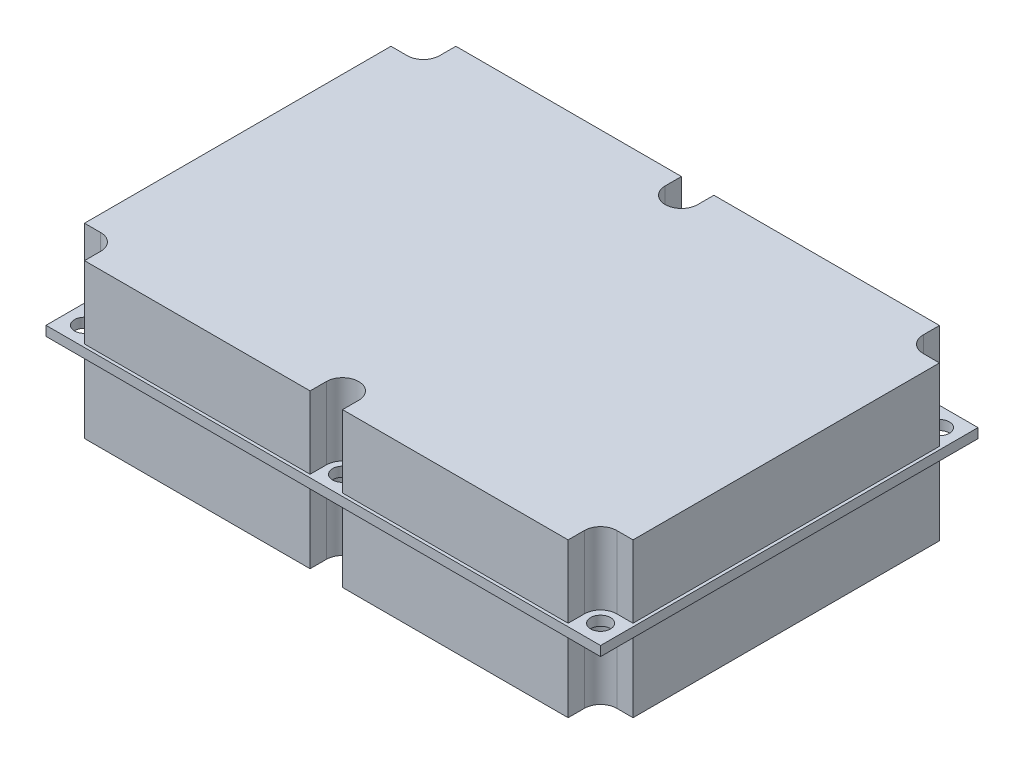
ISO-10303-21;
HEADER;
FILE_DESCRIPTION(('STEP AP214'),'2;1');
FILE_NAME('part.step','',(''),(''),'','','');
FILE_SCHEMA(('AUTOMOTIVE_DESIGN { 1 0 10303 214 1 1 1 1 }'));
ENDSEC;
DATA;
#1=APPLICATION_CONTEXT('core data for automotive mechanical design processes');
#2=APPLICATION_PROTOCOL_DEFINITION('international standard','automotive_design',2000,#1);
#3=PRODUCT_CONTEXT('',#1,'mechanical');
#4=PRODUCT('Part','Part','',(#3));
#5=PRODUCT_RELATED_PRODUCT_CATEGORY('part','',(#4));
#6=PRODUCT_DEFINITION_FORMATION('','',#4);
#7=PRODUCT_DEFINITION_CONTEXT('part definition',#1,'design');
#8=PRODUCT_DEFINITION('design','',#6,#7);
#9=PRODUCT_DEFINITION_SHAPE('','',#8);
#10=(LENGTH_UNIT() NAMED_UNIT(*) SI_UNIT(.MILLI.,.METRE.));
#11=(NAMED_UNIT(*) PLANE_ANGLE_UNIT() SI_UNIT($,.RADIAN.));
#12=(NAMED_UNIT(*) SI_UNIT($,.STERADIAN.) SOLID_ANGLE_UNIT());
#13=UNCERTAINTY_MEASURE_WITH_UNIT(LENGTH_MEASURE(1.E-05),#10,'distance_accuracy_value','');
#14=(GEOMETRIC_REPRESENTATION_CONTEXT(3) GLOBAL_UNCERTAINTY_ASSIGNED_CONTEXT((#13)) GLOBAL_UNIT_ASSIGNED_CONTEXT((#10,
#11,#12)) REPRESENTATION_CONTEXT('',''));
#15=CARTESIAN_POINT('',(0.,0.,0.));
#16=DIRECTION('',(0.,0.,1.));
#17=DIRECTION('',(1.,0.,0.));
#18=AXIS2_PLACEMENT_3D('',#15,#16,#17);
#19=CARTESIAN_POINT('',(-42.545,12.7,-27.94));
#20=DIRECTION('',(0.,-1.,0.));
#21=DIRECTION('',(0.,0.,-1.));
#22=AXIS2_PLACEMENT_3D('',#19,#20,#21);
#23=CYLINDRICAL_SURFACE('',#22,2.67499999999999);
#24=CARTESIAN_POINT('',(-42.545,-12.7,-27.94));
#25=DIRECTION('',(0.,-1.,0.));
#26=DIRECTION('',(0.,0.,1.));
#27=AXIS2_PLACEMENT_3D('',#24,#25,#26);
#28=CIRCLE('',#27,2.67499999999999);
#29=CARTESIAN_POINT('',(-39.87,-12.7,-27.94));
#30=VERTEX_POINT('',#29);
#31=CARTESIAN_POINT('',(-42.545,-12.7,-25.265));
#32=VERTEX_POINT('',#31);
#33=EDGE_CURVE('E238',#30,#32,#28,.T.);
#34=ORIENTED_EDGE('',*,*,#33,.T.);
#35=DIRECTION('',(0.,-1.,0.));
#36=VECTOR('',#35,1.);
#37=CARTESIAN_POINT('',(-42.545,12.7,-25.265));
#38=LINE('',#37,#36);
#39=CARTESIAN_POINT('',(-42.545,12.7,-25.265));
#40=VERTEX_POINT('',#39);
#41=EDGE_CURVE('E12',#40,#32,#38,.T.);
#42=ORIENTED_EDGE('',*,*,#41,.F.);
#43=CARTESIAN_POINT('',(-42.545,12.7,-27.94));
#44=DIRECTION('',(0.,-1.,0.));
#45=DIRECTION('',(0.,0.,1.));
#46=AXIS2_PLACEMENT_3D('',#43,#44,#45);
#47=CIRCLE('',#46,2.67499999999999);
#48=CARTESIAN_POINT('',(-39.87,12.7,-27.94));
#49=VERTEX_POINT('',#48);
#50=EDGE_CURVE('E284',#49,#40,#47,.T.);
#51=ORIENTED_EDGE('',*,*,#50,.F.);
#52=DIRECTION('',(0.,-1.,0.));
#53=VECTOR('',#52,1.);
#54=CARTESIAN_POINT('',(-39.87,12.7,-27.94));
#55=LINE('',#54,#53);
#56=EDGE_CURVE('E234',#49,#30,#55,.T.);
#57=ORIENTED_EDGE('',*,*,#56,.T.);
#58=EDGE_LOOP('',(#34,#42,#51,#57));
#59=FACE_BOUND('',#58,.T.);
#60=ADVANCED_FACE('F46',(#59),#23,.F.);
#61=CARTESIAN_POINT('',(-42.545,12.7,-25.265));
#62=DIRECTION('',(0.,0.,1.));
#63=DIRECTION('',(1.,0.,0.));
#64=AXIS2_PLACEMENT_3D('',#61,#62,#63);
#65=PLANE('',#64);
#66=DIRECTION('',(-1.,0.,0.));
#67=VECTOR('',#66,1.);
#68=CARTESIAN_POINT('',(-42.545,-12.7,-25.265));
#69=LINE('',#68,#67);
#70=CARTESIAN_POINT('',(-45.22,-12.7,-25.265));
#71=VERTEX_POINT('',#70);
#72=EDGE_CURVE('E241',#32,#71,#69,.T.);
#73=ORIENTED_EDGE('',*,*,#72,.T.);
#74=DIRECTION('',(0.,-1.,0.));
#75=VECTOR('',#74,1.);
#76=CARTESIAN_POINT('',(-45.22,12.7,-25.265));
#77=LINE('',#76,#75);
#78=CARTESIAN_POINT('',(-45.22,12.7,-25.265));
#79=VERTEX_POINT('',#78);
#80=EDGE_CURVE('E54',#79,#71,#77,.T.);
#81=ORIENTED_EDGE('',*,*,#80,.F.);
#82=DIRECTION('',(-1.,0.,0.));
#83=VECTOR('',#82,1.);
#84=CARTESIAN_POINT('',(-42.545,12.7,-25.265));
#85=LINE('',#84,#83);
#86=EDGE_CURVE('E153',#40,#79,#85,.T.);
#87=ORIENTED_EDGE('',*,*,#86,.F.);
#88=ORIENTED_EDGE('',*,*,#41,.T.);
#89=EDGE_LOOP('',(#73,#81,#87,#88));
#90=FACE_BOUND('',#89,.T.);
#91=ADVANCED_FACE('F422',(#90),#65,.F.);
#92=CARTESIAN_POINT('',(-45.22,12.7,-25.265));
#93=DIRECTION('',(1.,0.,0.));
#94=DIRECTION('',(0.,0.,-1.));
#95=AXIS2_PLACEMENT_3D('',#92,#93,#94);
#96=PLANE('',#95);
#97=DIRECTION('',(0.,0.,1.));
#98=VECTOR('',#97,1.);
#99=CARTESIAN_POINT('',(-45.22,-12.7,-25.265));
#100=LINE('',#99,#98);
#101=CARTESIAN_POINT('',(-45.22,-12.7,25.265));
#102=VERTEX_POINT('',#101);
#103=EDGE_CURVE('E243',#71,#102,#100,.T.);
#104=ORIENTED_EDGE('',*,*,#103,.T.);
#105=DIRECTION('',(0.,-1.,0.));
#106=VECTOR('',#105,1.);
#107=CARTESIAN_POINT('',(-45.22,12.7,25.265));
#108=LINE('',#107,#106);
#109=CARTESIAN_POINT('',(-45.22,12.7,25.265));
#110=VERTEX_POINT('',#109);
#111=EDGE_CURVE('E339',#110,#102,#108,.T.);
#112=ORIENTED_EDGE('',*,*,#111,.F.);
#113=DIRECTION('',(0.,0.,1.));
#114=VECTOR('',#113,1.);
#115=CARTESIAN_POINT('',(-45.22,12.7,-25.265));
#116=LINE('',#115,#114);
#117=EDGE_CURVE('E347',#79,#110,#116,.T.);
#118=ORIENTED_EDGE('',*,*,#117,.F.);
#119=ORIENTED_EDGE('',*,*,#80,.T.);
#120=EDGE_LOOP('',(#104,#112,#118,#119));
#121=FACE_BOUND('',#120,.T.);
#122=ADVANCED_FACE('F345',(#121),#96,.F.);
#123=CARTESIAN_POINT('',(-42.545,12.7,25.265));
#124=DIRECTION('',(0.,0.,-1.));
#125=DIRECTION('',(-1.,0.,0.));
#126=AXIS2_PLACEMENT_3D('',#123,#124,#125);
#127=PLANE('',#126);
#128=DIRECTION('',(1.,0.,0.));
#129=VECTOR('',#128,1.);
#130=CARTESIAN_POINT('',(-42.545,-12.7,25.265));
#131=LINE('',#130,#129);
#132=CARTESIAN_POINT('',(-42.545,-12.7,25.265));
#133=VERTEX_POINT('',#132);
#134=EDGE_CURVE('E245',#102,#133,#131,.T.);
#135=ORIENTED_EDGE('',*,*,#134,.T.);
#136=DIRECTION('',(0.,-1.,0.));
#137=VECTOR('',#136,1.);
#138=CARTESIAN_POINT('',(-42.545,12.7,25.265));
#139=LINE('',#138,#137);
#140=CARTESIAN_POINT('',(-42.545,12.7,25.265));
#141=VERTEX_POINT('',#140);
#142=EDGE_CURVE('E336',#141,#133,#139,.T.);
#143=ORIENTED_EDGE('',*,*,#142,.F.);
#144=DIRECTION('',(1.,0.,0.));
#145=VECTOR('',#144,1.);
#146=CARTESIAN_POINT('',(-42.545,12.7,25.265));
#147=LINE('',#146,#145);
#148=EDGE_CURVE('E365',#110,#141,#147,.T.);
#149=ORIENTED_EDGE('',*,*,#148,.F.);
#150=ORIENTED_EDGE('',*,*,#111,.T.);
#151=EDGE_LOOP('',(#135,#143,#149,#150));
#152=FACE_BOUND('',#151,.T.);
#153=ADVANCED_FACE('F356',(#152),#127,.F.);
#154=CARTESIAN_POINT('',(-42.545,12.7,27.94));
#155=DIRECTION('',(0.,-1.,0.));
#156=DIRECTION('',(0.,0.,-1.));
#157=AXIS2_PLACEMENT_3D('',#154,#155,#156);
#158=CYLINDRICAL_SURFACE('',#157,2.67500000000001);
#159=CARTESIAN_POINT('',(-42.545,-12.7,27.94));
#160=DIRECTION('',(0.,-1.,0.));
#161=DIRECTION('',(0.,0.,1.));
#162=AXIS2_PLACEMENT_3D('',#159,#160,#161);
#163=CIRCLE('',#162,2.67500000000001);
#164=CARTESIAN_POINT('',(-39.87,-12.7,27.94));
#165=VERTEX_POINT('',#164);
#166=EDGE_CURVE('E247',#133,#165,#163,.T.);
#167=ORIENTED_EDGE('',*,*,#166,.T.);
#168=DIRECTION('',(0.,-1.,0.));
#169=VECTOR('',#168,1.);
#170=CARTESIAN_POINT('',(-39.87,12.7,27.94));
#171=LINE('',#170,#169);
#172=CARTESIAN_POINT('',(-39.87,12.7,27.94));
#173=VERTEX_POINT('',#172);
#174=EDGE_CURVE('E333',#173,#165,#171,.T.);
#175=ORIENTED_EDGE('',*,*,#174,.F.);
#176=CARTESIAN_POINT('',(-42.545,12.7,27.94));
#177=DIRECTION('',(0.,-1.,0.));
#178=DIRECTION('',(0.,0.,1.));
#179=AXIS2_PLACEMENT_3D('',#176,#177,#178);
#180=CIRCLE('',#179,2.67500000000001);
#181=EDGE_CURVE('E362',#141,#173,#180,.T.);
#182=ORIENTED_EDGE('',*,*,#181,.F.);
#183=ORIENTED_EDGE('',*,*,#142,.T.);
#184=EDGE_LOOP('',(#167,#175,#182,#183));
#185=FACE_BOUND('',#184,.T.);
#186=ADVANCED_FACE('F360',(#185),#158,.F.);
#187=CARTESIAN_POINT('',(-39.87,12.7,27.94));
#188=DIRECTION('',(1.,0.,0.));
#189=DIRECTION('',(0.,0.,-1.));
#190=AXIS2_PLACEMENT_3D('',#187,#188,#189);
#191=PLANE('',#190);
#192=DIRECTION('',(0.,0.,1.));
#193=VECTOR('',#192,1.);
#194=CARTESIAN_POINT('',(-39.87,-12.7,27.94));
#195=LINE('',#194,#193);
#196=CARTESIAN_POINT('',(-39.87,-12.7,30.615));
#197=VERTEX_POINT('',#196);
#198=EDGE_CURVE('E249',#165,#197,#195,.T.);
#199=ORIENTED_EDGE('',*,*,#198,.T.);
#200=DIRECTION('',(0.,-1.,0.));
#201=VECTOR('',#200,1.);
#202=CARTESIAN_POINT('',(-39.87,12.7,30.615));
#203=LINE('',#202,#201);
#204=CARTESIAN_POINT('',(-39.87,12.7,30.615));
#205=VERTEX_POINT('',#204);
#206=EDGE_CURVE('E330',#205,#197,#203,.T.);
#207=ORIENTED_EDGE('',*,*,#206,.F.);
#208=DIRECTION('',(0.,0.,1.));
#209=VECTOR('',#208,1.);
#210=CARTESIAN_POINT('',(-39.87,12.7,27.94));
#211=LINE('',#210,#209);
#212=EDGE_CURVE('E364',#173,#205,#211,.T.);
#213=ORIENTED_EDGE('',*,*,#212,.F.);
#214=ORIENTED_EDGE('',*,*,#174,.T.);
#215=EDGE_LOOP('',(#199,#207,#213,#214));
#216=FACE_BOUND('',#215,.T.);
#217=ADVANCED_FACE('F435',(#216),#191,.F.);
#218=CARTESIAN_POINT('',(-39.87,12.7,30.615));
#219=DIRECTION('',(0.,0.,-1.));
#220=DIRECTION('',(-1.,0.,0.));
#221=AXIS2_PLACEMENT_3D('',#218,#219,#220);
#222=PLANE('',#221);
#223=DIRECTION('',(1.,0.,0.));
#224=VECTOR('',#223,1.);
#225=CARTESIAN_POINT('',(-39.87,-12.7,30.615));
#226=LINE('',#225,#224);
#227=CARTESIAN_POINT('',(-2.675,-12.7,30.615));
#228=VERTEX_POINT('',#227);
#229=EDGE_CURVE('E251',#197,#228,#226,.T.);
#230=ORIENTED_EDGE('',*,*,#229,.T.);
#231=DIRECTION('',(0.,-1.,0.));
#232=VECTOR('',#231,1.);
#233=CARTESIAN_POINT('',(-2.675,12.7,30.615));
#234=LINE('',#233,#232);
#235=CARTESIAN_POINT('',(-2.675,12.7,30.615));
#236=VERTEX_POINT('',#235);
#237=EDGE_CURVE('E327',#236,#228,#234,.T.);
#238=ORIENTED_EDGE('',*,*,#237,.F.);
#239=DIRECTION('',(1.,0.,0.));
#240=VECTOR('',#239,1.);
#241=CARTESIAN_POINT('',(-39.87,12.7,30.615));
#242=LINE('',#241,#240);
#243=EDGE_CURVE('E367',#205,#236,#242,.T.);
#244=ORIENTED_EDGE('',*,*,#243,.F.);
#245=ORIENTED_EDGE('',*,*,#206,.T.);
#246=EDGE_LOOP('',(#230,#238,#244,#245));
#247=FACE_BOUND('',#246,.T.);
#248=ADVANCED_FACE('F438',(#247),#222,.F.);
#249=CARTESIAN_POINT('',(-2.67499999999998,12.7,27.94));
#250=DIRECTION('',(-1.,0.,0.));
#251=DIRECTION('',(0.,0.,1.));
#252=AXIS2_PLACEMENT_3D('',#249,#250,#251);
#253=PLANE('',#252);
#254=DIRECTION('',(0.,0.,-1.));
#255=VECTOR('',#254,1.);
#256=CARTESIAN_POINT('',(-2.67499999999998,-12.7,27.94));
#257=LINE('',#256,#255);
#258=CARTESIAN_POINT('',(-2.67499999999998,-12.7,27.94));
#259=VERTEX_POINT('',#258);
#260=EDGE_CURVE('E253',#228,#259,#257,.T.);
#261=ORIENTED_EDGE('',*,*,#260,.T.);
#262=DIRECTION('',(0.,-1.,0.));
#263=VECTOR('',#262,1.);
#264=CARTESIAN_POINT('',(-2.67499999999998,12.7,27.94));
#265=LINE('',#264,#263);
#266=CARTESIAN_POINT('',(-2.67499999999998,12.7,27.94));
#267=VERTEX_POINT('',#266);
#268=EDGE_CURVE('E324',#267,#259,#265,.T.);
#269=ORIENTED_EDGE('',*,*,#268,.F.);
#270=DIRECTION('',(0.,0.,-1.));
#271=VECTOR('',#270,1.);
#272=CARTESIAN_POINT('',(-2.67499999999998,12.7,27.94));
#273=LINE('',#272,#271);
#274=EDGE_CURVE('E373',#236,#267,#273,.T.);
#275=ORIENTED_EDGE('',*,*,#274,.F.);
#276=ORIENTED_EDGE('',*,*,#237,.T.);
#277=EDGE_LOOP('',(#261,#269,#275,#276));
#278=FACE_BOUND('',#277,.T.);
#279=ADVANCED_FACE('F442',(#278),#253,.F.);
#280=CARTESIAN_POINT('',(0.,12.7,27.94));
#281=DIRECTION('',(0.,-1.,0.));
#282=DIRECTION('',(0.,0.,-1.));
#283=AXIS2_PLACEMENT_3D('',#280,#281,#282);
#284=CYLINDRICAL_SURFACE('',#283,2.67499999999999);
#285=CARTESIAN_POINT('',(0.,-12.7,27.94));
#286=DIRECTION('',(0.,-1.,0.));
#287=DIRECTION('',(0.,0.,1.));
#288=AXIS2_PLACEMENT_3D('',#285,#286,#287);
#289=CIRCLE('',#288,2.67499999999999);
#290=CARTESIAN_POINT('',(2.675,-12.7,27.94));
#291=VERTEX_POINT('',#290);
#292=EDGE_CURVE('E255',#259,#291,#289,.T.);
#293=ORIENTED_EDGE('',*,*,#292,.T.);
#294=DIRECTION('',(0.,-1.,0.));
#295=VECTOR('',#294,1.);
#296=CARTESIAN_POINT('',(2.675,12.7,27.94));
#297=LINE('',#296,#295);
#298=CARTESIAN_POINT('',(2.675,12.7,27.94));
#299=VERTEX_POINT('',#298);
#300=EDGE_CURVE('E321',#299,#291,#297,.T.);
#301=ORIENTED_EDGE('',*,*,#300,.F.);
#302=CARTESIAN_POINT('',(0.,12.7,27.94));
#303=DIRECTION('',(0.,-1.,0.));
#304=DIRECTION('',(0.,0.,1.));
#305=AXIS2_PLACEMENT_3D('',#302,#303,#304);
#306=CIRCLE('',#305,2.67499999999999);
#307=EDGE_CURVE('E375',#267,#299,#306,.T.);
#308=ORIENTED_EDGE('',*,*,#307,.F.);
#309=ORIENTED_EDGE('',*,*,#268,.T.);
#310=EDGE_LOOP('',(#293,#301,#308,#309));
#311=FACE_BOUND('',#310,.T.);
#312=ADVANCED_FACE('F446',(#311),#284,.F.);
#313=CARTESIAN_POINT('',(2.675,12.7,27.94));
#314=DIRECTION('',(1.,0.,0.));
#315=DIRECTION('',(0.,0.,-1.));
#316=AXIS2_PLACEMENT_3D('',#313,#314,#315);
#317=PLANE('',#316);
#318=DIRECTION('',(0.,0.,1.));
#319=VECTOR('',#318,1.);
#320=CARTESIAN_POINT('',(2.675,-12.7,27.94));
#321=LINE('',#320,#319);
#322=CARTESIAN_POINT('',(2.675,-12.7,30.615));
#323=VERTEX_POINT('',#322);
#324=EDGE_CURVE('E257',#291,#323,#321,.T.);
#325=ORIENTED_EDGE('',*,*,#324,.T.);
#326=DIRECTION('',(0.,-1.,0.));
#327=VECTOR('',#326,1.);
#328=CARTESIAN_POINT('',(2.675,12.7,30.615));
#329=LINE('',#328,#327);
#330=CARTESIAN_POINT('',(2.675,12.7,30.615));
#331=VERTEX_POINT('',#330);
#332=EDGE_CURVE('E318',#331,#323,#329,.T.);
#333=ORIENTED_EDGE('',*,*,#332,.F.);
#334=DIRECTION('',(0.,0.,1.));
#335=VECTOR('',#334,1.);
#336=CARTESIAN_POINT('',(2.675,12.7,27.94));
#337=LINE('',#336,#335);
#338=EDGE_CURVE('E377',#299,#331,#337,.T.);
#339=ORIENTED_EDGE('',*,*,#338,.F.);
#340=ORIENTED_EDGE('',*,*,#300,.T.);
#341=EDGE_LOOP('',(#325,#333,#339,#340));
#342=FACE_BOUND('',#341,.T.);
#343=ADVANCED_FACE('F450',(#342),#317,.F.);
#344=CARTESIAN_POINT('',(2.675,12.7,30.615));
#345=DIRECTION('',(0.,0.,-1.));
#346=DIRECTION('',(-1.,0.,0.));
#347=AXIS2_PLACEMENT_3D('',#344,#345,#346);
#348=PLANE('',#347);
#349=DIRECTION('',(1.,0.,0.));
#350=VECTOR('',#349,1.);
#351=CARTESIAN_POINT('',(2.675,-12.7,30.615));
#352=LINE('',#351,#350);
#353=CARTESIAN_POINT('',(39.87,-12.7,30.615));
#354=VERTEX_POINT('',#353);
#355=EDGE_CURVE('E259',#323,#354,#352,.T.);
#356=ORIENTED_EDGE('',*,*,#355,.T.);
#357=DIRECTION('',(0.,-1.,0.));
#358=VECTOR('',#357,1.);
#359=CARTESIAN_POINT('',(39.87,12.7,30.615));
#360=LINE('',#359,#358);
#361=CARTESIAN_POINT('',(39.87,12.7,30.615));
#362=VERTEX_POINT('',#361);
#363=EDGE_CURVE('E315',#362,#354,#360,.T.);
#364=ORIENTED_EDGE('',*,*,#363,.F.);
#365=DIRECTION('',(1.,0.,0.));
#366=VECTOR('',#365,1.);
#367=CARTESIAN_POINT('',(2.675,12.7,30.615));
#368=LINE('',#367,#366);
#369=EDGE_CURVE('E379',#331,#362,#368,.T.);
#370=ORIENTED_EDGE('',*,*,#369,.F.);
#371=ORIENTED_EDGE('',*,*,#332,.T.);
#372=EDGE_LOOP('',(#356,#364,#370,#371));
#373=FACE_BOUND('',#372,.T.);
#374=ADVANCED_FACE('F454',(#373),#348,.F.);
#375=CARTESIAN_POINT('',(39.87,12.7,27.94));
#376=DIRECTION('',(-1.,0.,0.));
#377=DIRECTION('',(0.,0.,1.));
#378=AXIS2_PLACEMENT_3D('',#375,#376,#377);
#379=PLANE('',#378);
#380=DIRECTION('',(0.,0.,-1.));
#381=VECTOR('',#380,1.);
#382=CARTESIAN_POINT('',(39.87,-12.7,27.94));
#383=LINE('',#382,#381);
#384=CARTESIAN_POINT('',(39.87,-12.7,27.94));
#385=VERTEX_POINT('',#384);
#386=EDGE_CURVE('E261',#354,#385,#383,.T.);
#387=ORIENTED_EDGE('',*,*,#386,.T.);
#388=DIRECTION('',(0.,-1.,0.));
#389=VECTOR('',#388,1.);
#390=CARTESIAN_POINT('',(39.87,12.7,27.94));
#391=LINE('',#390,#389);
#392=CARTESIAN_POINT('',(39.87,12.7,27.94));
#393=VERTEX_POINT('',#392);
#394=EDGE_CURVE('E312',#393,#385,#391,.T.);
#395=ORIENTED_EDGE('',*,*,#394,.F.);
#396=DIRECTION('',(0.,0.,-1.));
#397=VECTOR('',#396,1.);
#398=CARTESIAN_POINT('',(39.87,12.7,27.94));
#399=LINE('',#398,#397);
#400=EDGE_CURVE('E381',#362,#393,#399,.T.);
#401=ORIENTED_EDGE('',*,*,#400,.F.);
#402=ORIENTED_EDGE('',*,*,#363,.T.);
#403=EDGE_LOOP('',(#387,#395,#401,#402));
#404=FACE_BOUND('',#403,.T.);
#405=ADVANCED_FACE('F458',(#404),#379,.F.);
#406=CARTESIAN_POINT('',(42.545,12.7,27.94));
#407=DIRECTION('',(0.,-1.,0.));
#408=DIRECTION('',(0.,0.,-1.));
#409=AXIS2_PLACEMENT_3D('',#406,#407,#408);
#410=CYLINDRICAL_SURFACE('',#409,2.67499999999998);
#411=CARTESIAN_POINT('',(42.545,-12.7,27.94));
#412=DIRECTION('',(0.,-1.,0.));
#413=DIRECTION('',(0.,0.,1.));
#414=AXIS2_PLACEMENT_3D('',#411,#412,#413);
#415=CIRCLE('',#414,2.67499999999998);
#416=CARTESIAN_POINT('',(42.545,-12.7,25.265));
#417=VERTEX_POINT('',#416);
#418=EDGE_CURVE('E263',#385,#417,#415,.T.);
#419=ORIENTED_EDGE('',*,*,#418,.T.);
#420=DIRECTION('',(0.,-1.,0.));
#421=VECTOR('',#420,1.);
#422=CARTESIAN_POINT('',(42.545,12.7,25.265));
#423=LINE('',#422,#421);
#424=CARTESIAN_POINT('',(42.545,12.7,25.265));
#425=VERTEX_POINT('',#424);
#426=EDGE_CURVE('E309',#425,#417,#423,.T.);
#427=ORIENTED_EDGE('',*,*,#426,.F.);
#428=CARTESIAN_POINT('',(42.545,12.7,27.94));
#429=DIRECTION('',(0.,-1.,0.));
#430=DIRECTION('',(0.,0.,1.));
#431=AXIS2_PLACEMENT_3D('',#428,#429,#430);
#432=CIRCLE('',#431,2.67499999999998);
#433=EDGE_CURVE('E383',#393,#425,#432,.T.);
#434=ORIENTED_EDGE('',*,*,#433,.F.);
#435=ORIENTED_EDGE('',*,*,#394,.T.);
#436=EDGE_LOOP('',(#419,#427,#434,#435));
#437=FACE_BOUND('',#436,.T.);
#438=ADVANCED_FACE('F462',(#437),#410,.F.);
#439=CARTESIAN_POINT('',(42.545,12.7,25.265));
#440=DIRECTION('',(0.,0.,-1.));
#441=DIRECTION('',(-1.,0.,0.));
#442=AXIS2_PLACEMENT_3D('',#439,#440,#441);
#443=PLANE('',#442);
#444=DIRECTION('',(1.,0.,0.));
#445=VECTOR('',#444,1.);
#446=CARTESIAN_POINT('',(42.545,-12.7,25.265));
#447=LINE('',#446,#445);
#448=CARTESIAN_POINT('',(45.22,-12.7,25.265));
#449=VERTEX_POINT('',#448);
#450=EDGE_CURVE('E265',#417,#449,#447,.T.);
#451=ORIENTED_EDGE('',*,*,#450,.T.);
#452=DIRECTION('',(0.,-1.,0.));
#453=VECTOR('',#452,1.);
#454=CARTESIAN_POINT('',(45.22,12.7,25.265));
#455=LINE('',#454,#453);
#456=CARTESIAN_POINT('',(45.22,12.7,25.265));
#457=VERTEX_POINT('',#456);
#458=EDGE_CURVE('E306',#457,#449,#455,.T.);
#459=ORIENTED_EDGE('',*,*,#458,.F.);
#460=DIRECTION('',(1.,0.,0.));
#461=VECTOR('',#460,1.);
#462=CARTESIAN_POINT('',(42.545,12.7,25.265));
#463=LINE('',#462,#461);
#464=EDGE_CURVE('E385',#425,#457,#463,.T.);
#465=ORIENTED_EDGE('',*,*,#464,.F.);
#466=ORIENTED_EDGE('',*,*,#426,.T.);
#467=EDGE_LOOP('',(#451,#459,#465,#466));
#468=FACE_BOUND('',#467,.T.);
#469=ADVANCED_FACE('F466',(#468),#443,.F.);
#470=CARTESIAN_POINT('',(45.22,12.7,25.265));
#471=DIRECTION('',(-1.,0.,0.));
#472=DIRECTION('',(0.,0.,1.));
#473=AXIS2_PLACEMENT_3D('',#470,#471,#472);
#474=PLANE('',#473);
#475=DIRECTION('',(0.,0.,-1.));
#476=VECTOR('',#475,1.);
#477=CARTESIAN_POINT('',(45.22,-12.7,25.265));
#478=LINE('',#477,#476);
#479=CARTESIAN_POINT('',(45.22,-12.7,-25.265));
#480=VERTEX_POINT('',#479);
#481=EDGE_CURVE('E267',#449,#480,#478,.T.);
#482=ORIENTED_EDGE('',*,*,#481,.T.);
#483=DIRECTION('',(0.,-1.,0.));
#484=VECTOR('',#483,1.);
#485=CARTESIAN_POINT('',(45.22,12.7,-25.265));
#486=LINE('',#485,#484);
#487=CARTESIAN_POINT('',(45.22,12.7,-25.265));
#488=VERTEX_POINT('',#487);
#489=EDGE_CURVE('E303',#488,#480,#486,.T.);
#490=ORIENTED_EDGE('',*,*,#489,.F.);
#491=DIRECTION('',(0.,0.,-1.));
#492=VECTOR('',#491,1.);
#493=CARTESIAN_POINT('',(45.22,12.7,25.265));
#494=LINE('',#493,#492);
#495=EDGE_CURVE('E387',#457,#488,#494,.T.);
#496=ORIENTED_EDGE('',*,*,#495,.F.);
#497=ORIENTED_EDGE('',*,*,#458,.T.);
#498=EDGE_LOOP('',(#482,#490,#496,#497));
#499=FACE_BOUND('',#498,.T.);
#500=ADVANCED_FACE('F470',(#499),#474,.F.);
#501=CARTESIAN_POINT('',(42.545,12.7,-25.265));
#502=DIRECTION('',(0.,0.,1.));
#503=DIRECTION('',(1.,0.,0.));
#504=AXIS2_PLACEMENT_3D('',#501,#502,#503);
#505=PLANE('',#504);
#506=DIRECTION('',(-1.,0.,0.));
#507=VECTOR('',#506,1.);
#508=CARTESIAN_POINT('',(42.545,-12.7,-25.265));
#509=LINE('',#508,#507);
#510=CARTESIAN_POINT('',(42.545,-12.7,-25.265));
#511=VERTEX_POINT('',#510);
#512=EDGE_CURVE('E269',#480,#511,#509,.T.);
#513=ORIENTED_EDGE('',*,*,#512,.T.);
#514=DIRECTION('',(0.,-1.,0.));
#515=VECTOR('',#514,1.);
#516=CARTESIAN_POINT('',(42.545,12.7,-25.265));
#517=LINE('',#516,#515);
#518=CARTESIAN_POINT('',(42.545,12.7,-25.265));
#519=VERTEX_POINT('',#518);
#520=EDGE_CURVE('E300',#519,#511,#517,.T.);
#521=ORIENTED_EDGE('',*,*,#520,.F.);
#522=DIRECTION('',(-1.,0.,0.));
#523=VECTOR('',#522,1.);
#524=CARTESIAN_POINT('',(42.545,12.7,-25.265));
#525=LINE('',#524,#523);
#526=EDGE_CURVE('E389',#488,#519,#525,.T.);
#527=ORIENTED_EDGE('',*,*,#526,.F.);
#528=ORIENTED_EDGE('',*,*,#489,.T.);
#529=EDGE_LOOP('',(#513,#521,#527,#528));
#530=FACE_BOUND('',#529,.T.);
#531=ADVANCED_FACE('F474',(#530),#505,.F.);
#532=CARTESIAN_POINT('',(42.545,12.7,-27.94));
#533=DIRECTION('',(0.,-1.,0.));
#534=DIRECTION('',(0.,0.,-1.));
#535=AXIS2_PLACEMENT_3D('',#532,#533,#534);
#536=CYLINDRICAL_SURFACE('',#535,2.675);
#537=CARTESIAN_POINT('',(42.545,-12.7,-27.94));
#538=DIRECTION('',(0.,-1.,0.));
#539=DIRECTION('',(0.,0.,1.));
#540=AXIS2_PLACEMENT_3D('',#537,#538,#539);
#541=CIRCLE('',#540,2.675);
#542=CARTESIAN_POINT('',(39.87,-12.7,-27.94));
#543=VERTEX_POINT('',#542);
#544=EDGE_CURVE('E271',#511,#543,#541,.T.);
#545=ORIENTED_EDGE('',*,*,#544,.T.);
#546=DIRECTION('',(0.,-1.,0.));
#547=VECTOR('',#546,1.);
#548=CARTESIAN_POINT('',(39.87,12.7,-27.94));
#549=LINE('',#548,#547);
#550=CARTESIAN_POINT('',(39.87,12.7,-27.94));
#551=VERTEX_POINT('',#550);
#552=EDGE_CURVE('E297',#551,#543,#549,.T.);
#553=ORIENTED_EDGE('',*,*,#552,.F.);
#554=CARTESIAN_POINT('',(42.545,12.7,-27.94));
#555=DIRECTION('',(0.,-1.,0.));
#556=DIRECTION('',(0.,0.,1.));
#557=AXIS2_PLACEMENT_3D('',#554,#555,#556);
#558=CIRCLE('',#557,2.675);
#559=EDGE_CURVE('E391',#519,#551,#558,.T.);
#560=ORIENTED_EDGE('',*,*,#559,.F.);
#561=ORIENTED_EDGE('',*,*,#520,.T.);
#562=EDGE_LOOP('',(#545,#553,#560,#561));
#563=FACE_BOUND('',#562,.T.);
#564=ADVANCED_FACE('F478',(#563),#536,.F.);
#565=CARTESIAN_POINT('',(39.87,12.7,-27.94));
#566=DIRECTION('',(-1.,0.,0.));
#567=DIRECTION('',(0.,0.,1.));
#568=AXIS2_PLACEMENT_3D('',#565,#566,#567);
#569=PLANE('',#568);
#570=DIRECTION('',(0.,0.,-1.));
#571=VECTOR('',#570,1.);
#572=CARTESIAN_POINT('',(39.87,-12.7,-27.94));
#573=LINE('',#572,#571);
#574=CARTESIAN_POINT('',(39.87,-12.7,-30.615));
#575=VERTEX_POINT('',#574);
#576=EDGE_CURVE('E273',#543,#575,#573,.T.);
#577=ORIENTED_EDGE('',*,*,#576,.T.);
#578=DIRECTION('',(0.,-1.,0.));
#579=VECTOR('',#578,1.);
#580=CARTESIAN_POINT('',(39.87,12.7,-30.615));
#581=LINE('',#580,#579);
#582=CARTESIAN_POINT('',(39.87,12.7,-30.615));
#583=VERTEX_POINT('',#582);
#584=EDGE_CURVE('E294',#583,#575,#581,.T.);
#585=ORIENTED_EDGE('',*,*,#584,.F.);
#586=DIRECTION('',(0.,0.,-1.));
#587=VECTOR('',#586,1.);
#588=CARTESIAN_POINT('',(39.87,12.7,-27.94));
#589=LINE('',#588,#587);
#590=EDGE_CURVE('E393',#551,#583,#589,.T.);
#591=ORIENTED_EDGE('',*,*,#590,.F.);
#592=ORIENTED_EDGE('',*,*,#552,.T.);
#593=EDGE_LOOP('',(#577,#585,#591,#592));
#594=FACE_BOUND('',#593,.T.);
#595=ADVANCED_FACE('F482',(#594),#569,.F.);
#596=CARTESIAN_POINT('',(39.87,12.7,-30.615));
#597=DIRECTION('',(0.,0.,1.));
#598=DIRECTION('',(1.,0.,0.));
#599=AXIS2_PLACEMENT_3D('',#596,#597,#598);
#600=PLANE('',#599);
#601=DIRECTION('',(-1.,0.,0.));
#602=VECTOR('',#601,1.);
#603=CARTESIAN_POINT('',(39.87,-12.7,-30.615));
#604=LINE('',#603,#602);
#605=CARTESIAN_POINT('',(2.675,-12.7,-30.615));
#606=VERTEX_POINT('',#605);
#607=EDGE_CURVE('E275',#575,#606,#604,.T.);
#608=ORIENTED_EDGE('',*,*,#607,.T.);
#609=DIRECTION('',(0.,-1.,0.));
#610=VECTOR('',#609,1.);
#611=CARTESIAN_POINT('',(2.675,12.7,-30.615));
#612=LINE('',#611,#610);
#613=CARTESIAN_POINT('',(2.675,12.7,-30.615));
#614=VERTEX_POINT('',#613);
#615=EDGE_CURVE('E291',#614,#606,#612,.T.);
#616=ORIENTED_EDGE('',*,*,#615,.F.);
#617=DIRECTION('',(-1.,0.,0.));
#618=VECTOR('',#617,1.);
#619=CARTESIAN_POINT('',(39.87,12.7,-30.615));
#620=LINE('',#619,#618);
#621=EDGE_CURVE('E395',#583,#614,#620,.T.);
#622=ORIENTED_EDGE('',*,*,#621,.F.);
#623=ORIENTED_EDGE('',*,*,#584,.T.);
#624=EDGE_LOOP('',(#608,#616,#622,#623));
#625=FACE_BOUND('',#624,.T.);
#626=ADVANCED_FACE('F486',(#625),#600,.F.);
#627=CARTESIAN_POINT('',(2.675,12.7,-27.94));
#628=DIRECTION('',(1.,0.,0.));
#629=DIRECTION('',(0.,0.,-1.));
#630=AXIS2_PLACEMENT_3D('',#627,#628,#629);
#631=PLANE('',#630);
#632=DIRECTION('',(0.,0.,1.));
#633=VECTOR('',#632,1.);
#634=CARTESIAN_POINT('',(2.675,-12.7,-27.94));
#635=LINE('',#634,#633);
#636=CARTESIAN_POINT('',(2.675,-12.7,-27.94));
#637=VERTEX_POINT('',#636);
#638=EDGE_CURVE('E277',#606,#637,#635,.T.);
#639=ORIENTED_EDGE('',*,*,#638,.T.);
#640=DIRECTION('',(0.,-1.,0.));
#641=VECTOR('',#640,1.);
#642=CARTESIAN_POINT('',(2.675,12.7,-27.94));
#643=LINE('',#642,#641);
#644=CARTESIAN_POINT('',(2.675,12.7,-27.94));
#645=VERTEX_POINT('',#644);
#646=EDGE_CURVE('E288',#645,#637,#643,.T.);
#647=ORIENTED_EDGE('',*,*,#646,.F.);
#648=DIRECTION('',(0.,0.,1.));
#649=VECTOR('',#648,1.);
#650=CARTESIAN_POINT('',(2.675,12.7,-27.94));
#651=LINE('',#650,#649);
#652=EDGE_CURVE('E397',#614,#645,#651,.T.);
#653=ORIENTED_EDGE('',*,*,#652,.F.);
#654=ORIENTED_EDGE('',*,*,#615,.T.);
#655=EDGE_LOOP('',(#639,#647,#653,#654));
#656=FACE_BOUND('',#655,.T.);
#657=ADVANCED_FACE('F403',(#656),#631,.F.);
#658=CARTESIAN_POINT('',(0.,12.7,-27.94));
#659=DIRECTION('',(0.,-1.,0.));
#660=DIRECTION('',(0.,0.,-1.));
#661=AXIS2_PLACEMENT_3D('',#658,#659,#660);
#662=CYLINDRICAL_SURFACE('',#661,2.675);
#663=CARTESIAN_POINT('',(0.,-12.7,-27.94));
#664=DIRECTION('',(0.,-1.,0.));
#665=DIRECTION('',(0.,0.,1.));
#666=AXIS2_PLACEMENT_3D('',#663,#664,#665);
#667=CIRCLE('',#666,2.675);
#668=CARTESIAN_POINT('',(-2.675,-12.7,-27.94));
#669=VERTEX_POINT('',#668);
#670=EDGE_CURVE('E279',#637,#669,#667,.T.);
#671=ORIENTED_EDGE('',*,*,#670,.T.);
#672=DIRECTION('',(0.,-1.,0.));
#673=VECTOR('',#672,1.);
#674=CARTESIAN_POINT('',(-2.675,12.7,-27.94));
#675=LINE('',#674,#673);
#676=CARTESIAN_POINT('',(-2.675,12.7,-27.94));
#677=VERTEX_POINT('',#676);
#678=EDGE_CURVE('E229',#677,#669,#675,.T.);
#679=ORIENTED_EDGE('',*,*,#678,.F.);
#680=CARTESIAN_POINT('',(0.,12.7,-27.94));
#681=DIRECTION('',(0.,-1.,0.));
#682=DIRECTION('',(0.,0.,1.));
#683=AXIS2_PLACEMENT_3D('',#680,#681,#682);
#684=CIRCLE('',#683,2.675);
#685=EDGE_CURVE('E220',#645,#677,#684,.T.);
#686=ORIENTED_EDGE('',*,*,#685,.F.);
#687=ORIENTED_EDGE('',*,*,#646,.T.);
#688=EDGE_LOOP('',(#671,#679,#686,#687));
#689=FACE_BOUND('',#688,.T.);
#690=ADVANCED_FACE('F407',(#689),#662,.F.);
#691=CARTESIAN_POINT('',(-2.675,12.7,-27.94));
#692=DIRECTION('',(-1.,0.,0.));
#693=DIRECTION('',(0.,0.,1.));
#694=AXIS2_PLACEMENT_3D('',#691,#692,#693);
#695=PLANE('',#694);
#696=DIRECTION('',(0.,0.,-1.));
#697=VECTOR('',#696,1.);
#698=CARTESIAN_POINT('',(-2.675,-12.7,-27.94));
#699=LINE('',#698,#697);
#700=CARTESIAN_POINT('',(-2.675,-12.7,-30.615));
#701=VERTEX_POINT('',#700);
#702=EDGE_CURVE('E228',#669,#701,#699,.T.);
#703=ORIENTED_EDGE('',*,*,#702,.T.);
#704=DIRECTION('',(0.,-1.,0.));
#705=VECTOR('',#704,1.);
#706=CARTESIAN_POINT('',(-2.675,12.7,-30.615));
#707=LINE('',#706,#705);
#708=CARTESIAN_POINT('',(-2.675,12.7,-30.615));
#709=VERTEX_POINT('',#708);
#710=EDGE_CURVE('E225',#709,#701,#707,.T.);
#711=ORIENTED_EDGE('',*,*,#710,.F.);
#712=DIRECTION('',(0.,0.,-1.));
#713=VECTOR('',#712,1.);
#714=CARTESIAN_POINT('',(-2.675,12.7,-27.94));
#715=LINE('',#714,#713);
#716=EDGE_CURVE('E214',#677,#709,#715,.T.);
#717=ORIENTED_EDGE('',*,*,#716,.F.);
#718=ORIENTED_EDGE('',*,*,#678,.T.);
#719=EDGE_LOOP('',(#703,#711,#717,#718));
#720=FACE_BOUND('',#719,.T.);
#721=ADVANCED_FACE('F226',(#720),#695,.F.);
#722=CARTESIAN_POINT('',(-2.675,12.7,-30.615));
#723=DIRECTION('',(0.,0.,1.));
#724=DIRECTION('',(1.,0.,0.));
#725=AXIS2_PLACEMENT_3D('',#722,#723,#724);
#726=PLANE('',#725);
#727=DIRECTION('',(-1.,0.,0.));
#728=VECTOR('',#727,1.);
#729=CARTESIAN_POINT('',(-2.675,-12.7,-30.615));
#730=LINE('',#729,#728);
#731=CARTESIAN_POINT('',(-39.87,-12.7,-30.615));
#732=VERTEX_POINT('',#731);
#733=EDGE_CURVE('E139',#701,#732,#730,.T.);
#734=ORIENTED_EDGE('',*,*,#733,.T.);
#735=DIRECTION('',(0.,-1.,0.));
#736=VECTOR('',#735,1.);
#737=CARTESIAN_POINT('',(-39.87,12.7,-30.615));
#738=LINE('',#737,#736);
#739=CARTESIAN_POINT('',(-39.87,12.7,-30.615));
#740=VERTEX_POINT('',#739);
#741=EDGE_CURVE('E230',#740,#732,#738,.T.);
#742=ORIENTED_EDGE('',*,*,#741,.F.);
#743=DIRECTION('',(-1.,0.,0.));
#744=VECTOR('',#743,1.);
#745=CARTESIAN_POINT('',(-2.675,12.7,-30.615));
#746=LINE('',#745,#744);
#747=EDGE_CURVE('E218',#709,#740,#746,.T.);
#748=ORIENTED_EDGE('',*,*,#747,.F.);
#749=ORIENTED_EDGE('',*,*,#710,.T.);
#750=EDGE_LOOP('',(#734,#742,#748,#749));
#751=FACE_BOUND('',#750,.T.);
#752=ADVANCED_FACE('F232',(#751),#726,.F.);
#753=CARTESIAN_POINT('',(-39.87,12.7,-27.94));
#754=DIRECTION('',(1.,0.,0.));
#755=DIRECTION('',(0.,0.,-1.));
#756=AXIS2_PLACEMENT_3D('',#753,#754,#755);
#757=PLANE('',#756);
#758=DIRECTION('',(0.,0.,1.));
#759=VECTOR('',#758,1.);
#760=CARTESIAN_POINT('',(-39.87,-12.7,-27.94));
#761=LINE('',#760,#759);
#762=EDGE_CURVE('E145',#732,#30,#761,.T.);
#763=ORIENTED_EDGE('',*,*,#762,.T.);
#764=ORIENTED_EDGE('',*,*,#56,.F.);
#765=DIRECTION('',(0.,0.,1.));
#766=VECTOR('',#765,1.);
#767=CARTESIAN_POINT('',(-39.87,12.7,-27.94));
#768=LINE('',#767,#766);
#769=EDGE_CURVE('E62',#740,#49,#768,.T.);
#770=ORIENTED_EDGE('',*,*,#769,.F.);
#771=ORIENTED_EDGE('',*,*,#741,.T.);
#772=EDGE_LOOP('',(#763,#764,#770,#771));
#773=FACE_BOUND('',#772,.T.);
#774=ADVANCED_FACE('F411',(#773),#757,.F.);
#775=CARTESIAN_POINT('',(-42.545,12.7,-27.94));
#776=DIRECTION('',(0.,1.,0.));
#777=DIRECTION('',(0.,0.,1.));
#778=AXIS2_PLACEMENT_3D('',#775,#776,#777);
#779=PLANE('',#778);
#780=ORIENTED_EDGE('',*,*,#50,.T.);
#781=ORIENTED_EDGE('',*,*,#86,.T.);
#782=ORIENTED_EDGE('',*,*,#117,.T.);
#783=ORIENTED_EDGE('',*,*,#148,.T.);
#784=ORIENTED_EDGE('',*,*,#181,.T.);
#785=ORIENTED_EDGE('',*,*,#212,.T.);
#786=ORIENTED_EDGE('',*,*,#243,.T.);
#787=ORIENTED_EDGE('',*,*,#274,.T.);
#788=ORIENTED_EDGE('',*,*,#307,.T.);
#789=ORIENTED_EDGE('',*,*,#338,.T.);
#790=ORIENTED_EDGE('',*,*,#369,.T.);
#791=ORIENTED_EDGE('',*,*,#400,.T.);
#792=ORIENTED_EDGE('',*,*,#433,.T.);
#793=ORIENTED_EDGE('',*,*,#464,.T.);
#794=ORIENTED_EDGE('',*,*,#495,.T.);
#795=ORIENTED_EDGE('',*,*,#526,.T.);
#796=ORIENTED_EDGE('',*,*,#559,.T.);
#797=ORIENTED_EDGE('',*,*,#590,.T.);
#798=ORIENTED_EDGE('',*,*,#621,.T.);
#799=ORIENTED_EDGE('',*,*,#652,.T.);
#800=ORIENTED_EDGE('',*,*,#685,.T.);
#801=ORIENTED_EDGE('',*,*,#716,.T.);
#802=ORIENTED_EDGE('',*,*,#747,.T.);
#803=ORIENTED_EDGE('',*,*,#769,.T.);
#804=EDGE_LOOP('',(#780,#781,#782,#783,#784,#785,#786,#787,#788,#789,#790,#791,#792,#793,#794,
#795,#796,#797,#798,#799,#800,#801,#802,#803));
#805=FACE_BOUND('',#804,.T.);
#806=ADVANCED_FACE('F216',(#805),#779,.T.);
#807=CARTESIAN_POINT('',(-42.545,-12.7,-27.94));
#808=DIRECTION('',(0.,1.,0.));
#809=DIRECTION('',(0.,0.,1.));
#810=AXIS2_PLACEMENT_3D('',#807,#808,#809);
#811=PLANE('',#810);
#812=ORIENTED_EDGE('',*,*,#33,.F.);
#813=ORIENTED_EDGE('',*,*,#762,.F.);
#814=ORIENTED_EDGE('',*,*,#733,.F.);
#815=ORIENTED_EDGE('',*,*,#702,.F.);
#816=ORIENTED_EDGE('',*,*,#670,.F.);
#817=ORIENTED_EDGE('',*,*,#638,.F.);
#818=ORIENTED_EDGE('',*,*,#607,.F.);
#819=ORIENTED_EDGE('',*,*,#576,.F.);
#820=ORIENTED_EDGE('',*,*,#544,.F.);
#821=ORIENTED_EDGE('',*,*,#512,.F.);
#822=ORIENTED_EDGE('',*,*,#481,.F.);
#823=ORIENTED_EDGE('',*,*,#450,.F.);
#824=ORIENTED_EDGE('',*,*,#418,.F.);
#825=ORIENTED_EDGE('',*,*,#386,.F.);
#826=ORIENTED_EDGE('',*,*,#355,.F.);
#827=ORIENTED_EDGE('',*,*,#324,.F.);
#828=ORIENTED_EDGE('',*,*,#292,.F.);
#829=ORIENTED_EDGE('',*,*,#260,.F.);
#830=ORIENTED_EDGE('',*,*,#229,.F.);
#831=ORIENTED_EDGE('',*,*,#198,.F.);
#832=ORIENTED_EDGE('',*,*,#166,.F.);
#833=ORIENTED_EDGE('',*,*,#134,.F.);
#834=ORIENTED_EDGE('',*,*,#103,.F.);
#835=ORIENTED_EDGE('',*,*,#72,.F.);
#836=EDGE_LOOP('',(#812,#813,#814,#815,#816,#817,#818,#819,#820,#821,#822,#823,#824,#825,#826,
#827,#828,#829,#830,#831,#832,#833,#834,#835));
#837=FACE_BOUND('',#836,.T.);
#838=ADVANCED_FACE('F351',(#837),#811,.F.);
#839=CLOSED_SHELL('',(#60,#91,#122,#153,#186,#217,#248,#279,#312,#343,#374,#405,#438,#469,#500,
#531,#564,#595,#626,#657,#690,#721,#752,#774,#806,#838));
#840=MANIFOLD_SOLID_BREP('B2',#839);
#841=CARTESIAN_POINT('',(-45.72,0.79375,-31.115));
#842=DIRECTION('',(1.,0.,0.));
#843=DIRECTION('',(0.,0.,-1.));
#844=AXIS2_PLACEMENT_3D('',#841,#842,#843);
#845=PLANE('',#844);
#846=DIRECTION('',(0.,0.,1.));
#847=VECTOR('',#846,1.);
#848=CARTESIAN_POINT('',(-45.72,-0.79375,-31.115));
#849=LINE('',#848,#847);
#850=CARTESIAN_POINT('',(-45.72,-0.79375,-31.115));
#851=VERTEX_POINT('',#850);
#852=CARTESIAN_POINT('',(-45.72,-0.79375,31.115));
#853=VERTEX_POINT('',#852);
#854=EDGE_CURVE('E758',#851,#853,#849,.T.);
#855=ORIENTED_EDGE('',*,*,#854,.T.);
#856=DIRECTION('',(0.,-1.,0.));
#857=VECTOR('',#856,1.);
#858=CARTESIAN_POINT('',(-45.72,0.79375,31.115));
#859=LINE('',#858,#857);
#860=CARTESIAN_POINT('',(-45.72,0.79375,31.115));
#861=VERTEX_POINT('',#860);
#862=EDGE_CURVE('E749',#861,#853,#859,.T.);
#863=ORIENTED_EDGE('',*,*,#862,.F.);
#864=DIRECTION('',(0.,0.,1.));
#865=VECTOR('',#864,1.);
#866=CARTESIAN_POINT('',(-45.72,0.79375,-31.115));
#867=LINE('',#866,#865);
#868=CARTESIAN_POINT('',(-45.72,0.79375,-31.115));
#869=VERTEX_POINT('',#868);
#870=EDGE_CURVE('E743',#869,#861,#867,.T.);
#871=ORIENTED_EDGE('',*,*,#870,.F.);
#872=DIRECTION('',(0.,-1.,0.));
#873=VECTOR('',#872,1.);
#874=CARTESIAN_POINT('',(-45.72,0.79375,-31.115));
#875=LINE('',#874,#873);
#876=EDGE_CURVE('E754',#869,#851,#875,.T.);
#877=ORIENTED_EDGE('',*,*,#876,.T.);
#878=EDGE_LOOP('',(#855,#863,#871,#877));
#879=FACE_BOUND('',#878,.T.);
#880=ADVANCED_FACE('F689',(#879),#845,.F.);
#881=CARTESIAN_POINT('',(-45.72,0.79375,31.115));
#882=DIRECTION('',(0.,0.,-1.));
#883=DIRECTION('',(-1.,0.,0.));
#884=AXIS2_PLACEMENT_3D('',#881,#882,#883);
#885=PLANE('',#884);
#886=DIRECTION('',(1.,0.,0.));
#887=VECTOR('',#886,1.);
#888=CARTESIAN_POINT('',(-45.72,-0.79375,31.115));
#889=LINE('',#888,#887);
#890=CARTESIAN_POINT('',(45.72,-0.79375,31.115));
#891=VERTEX_POINT('',#890);
#892=EDGE_CURVE('E748',#853,#891,#889,.T.);
#893=ORIENTED_EDGE('',*,*,#892,.T.);
#894=DIRECTION('',(0.,-1.,0.));
#895=VECTOR('',#894,1.);
#896=CARTESIAN_POINT('',(45.72,0.79375,31.115));
#897=LINE('',#896,#895);
#898=CARTESIAN_POINT('',(45.72,0.79375,31.115));
#899=VERTEX_POINT('',#898);
#900=EDGE_CURVE('E746',#899,#891,#897,.T.);
#901=ORIENTED_EDGE('',*,*,#900,.F.);
#902=DIRECTION('',(1.,0.,0.));
#903=VECTOR('',#902,1.);
#904=CARTESIAN_POINT('',(-45.72,0.79375,31.115));
#905=LINE('',#904,#903);
#906=EDGE_CURVE('E737',#861,#899,#905,.T.);
#907=ORIENTED_EDGE('',*,*,#906,.F.);
#908=ORIENTED_EDGE('',*,*,#862,.T.);
#909=EDGE_LOOP('',(#893,#901,#907,#908));
#910=FACE_BOUND('',#909,.T.);
#911=ADVANCED_FACE('F747',(#910),#885,.F.);
#912=CARTESIAN_POINT('',(45.72,0.79375,-31.115));
#913=DIRECTION('',(-1.,0.,0.));
#914=DIRECTION('',(0.,0.,1.));
#915=AXIS2_PLACEMENT_3D('',#912,#913,#914);
#916=PLANE('',#915);
#917=DIRECTION('',(0.,0.,-1.));
#918=VECTOR('',#917,1.);
#919=CARTESIAN_POINT('',(45.72,-0.79375,-31.115));
#920=LINE('',#919,#918);
#921=CARTESIAN_POINT('',(45.72,-0.79375,-31.115));
#922=VERTEX_POINT('',#921);
#923=EDGE_CURVE('E723',#891,#922,#920,.T.);
#924=ORIENTED_EDGE('',*,*,#923,.T.);
#925=DIRECTION('',(0.,-1.,0.));
#926=VECTOR('',#925,1.);
#927=CARTESIAN_POINT('',(45.72,0.79375,-31.115));
#928=LINE('',#927,#926);
#929=CARTESIAN_POINT('',(45.72,0.79375,-31.115));
#930=VERTEX_POINT('',#929);
#931=EDGE_CURVE('E750',#930,#922,#928,.T.);
#932=ORIENTED_EDGE('',*,*,#931,.F.);
#933=DIRECTION('',(0.,0.,-1.));
#934=VECTOR('',#933,1.);
#935=CARTESIAN_POINT('',(45.72,0.79375,-31.115));
#936=LINE('',#935,#934);
#937=EDGE_CURVE('E741',#899,#930,#936,.T.);
#938=ORIENTED_EDGE('',*,*,#937,.F.);
#939=ORIENTED_EDGE('',*,*,#900,.T.);
#940=EDGE_LOOP('',(#924,#932,#938,#939));
#941=FACE_BOUND('',#940,.T.);
#942=ADVANCED_FACE('F752',(#941),#916,.F.);
#943=CARTESIAN_POINT('',(-45.72,0.79375,-31.115));
#944=DIRECTION('',(0.,0.,1.));
#945=DIRECTION('',(1.,0.,0.));
#946=AXIS2_PLACEMENT_3D('',#943,#944,#945);
#947=PLANE('',#946);
#948=DIRECTION('',(-1.,0.,0.));
#949=VECTOR('',#948,1.);
#950=CARTESIAN_POINT('',(-45.72,-0.79375,-31.115));
#951=LINE('',#950,#949);
#952=EDGE_CURVE('E729',#922,#851,#951,.T.);
#953=ORIENTED_EDGE('',*,*,#952,.T.);
#954=ORIENTED_EDGE('',*,*,#876,.F.);
#955=DIRECTION('',(-1.,0.,0.));
#956=VECTOR('',#955,1.);
#957=CARTESIAN_POINT('',(-45.72,0.79375,-31.115));
#958=LINE('',#957,#956);
#959=EDGE_CURVE('E706',#930,#869,#958,.T.);
#960=ORIENTED_EDGE('',*,*,#959,.F.);
#961=ORIENTED_EDGE('',*,*,#931,.T.);
#962=EDGE_LOOP('',(#953,#954,#960,#961));
#963=FACE_BOUND('',#962,.T.);
#964=ADVANCED_FACE('F796',(#963),#947,.F.);
#965=CARTESIAN_POINT('',(-45.72,0.79375,31.115));
#966=DIRECTION('',(0.,1.,0.));
#967=DIRECTION('',(0.,0.,1.));
#968=AXIS2_PLACEMENT_3D('',#965,#966,#967);
#969=PLANE('',#968);
#970=CARTESIAN_POINT('',(0.,0.79375,-27.94));
#971=DIRECTION('',(0.,1.,0.));
#972=DIRECTION('',(0.,0.,1.));
#973=AXIS2_PLACEMENT_3D('',#970,#971,#972);
#974=CIRCLE('',#973,1.6383);
#975=CARTESIAN_POINT('',(0.,0.79375,-26.3017));
#976=VERTEX_POINT('',#975);
#977=EDGE_CURVE('E914',#976,#976,#974,.T.);
#978=ORIENTED_EDGE('',*,*,#977,.F.);
#979=EDGE_LOOP('',(#978));
#980=FACE_BOUND('',#979,.T.);
#981=CARTESIAN_POINT('',(-42.545,0.79375,-27.94));
#982=DIRECTION('',(0.,1.,0.));
#983=DIRECTION('',(0.,0.,1.));
#984=AXIS2_PLACEMENT_3D('',#981,#982,#983);
#985=CIRCLE('',#984,1.6383);
#986=CARTESIAN_POINT('',(-42.545,0.79375,-26.3017));
#987=VERTEX_POINT('',#986);
#988=EDGE_CURVE('E913',#987,#987,#985,.T.);
#989=ORIENTED_EDGE('',*,*,#988,.F.);
#990=EDGE_LOOP('',(#989));
#991=FACE_BOUND('',#990,.T.);
#992=ORIENTED_EDGE('',*,*,#870,.T.);
#993=ORIENTED_EDGE('',*,*,#906,.T.);
#994=ORIENTED_EDGE('',*,*,#937,.T.);
#995=ORIENTED_EDGE('',*,*,#959,.T.);
#996=EDGE_LOOP('',(#992,#993,#994,#995));
#997=FACE_BOUND('',#996,.T.);
#998=CARTESIAN_POINT('',(42.545,0.79375,-27.94));
#999=DIRECTION('',(0.,1.,0.));
#1000=DIRECTION('',(0.,0.,1.));
#1001=AXIS2_PLACEMENT_3D('',#998,#999,#1000);
#1002=CIRCLE('',#1001,1.6383);
#1003=CARTESIAN_POINT('',(42.545,0.79375,-26.3017));
#1004=VERTEX_POINT('',#1003);
#1005=EDGE_CURVE('E771',#1004,#1004,#1002,.T.);
#1006=ORIENTED_EDGE('',*,*,#1005,.F.);
#1007=EDGE_LOOP('',(#1006));
#1008=FACE_BOUND('',#1007,.T.);
#1009=CARTESIAN_POINT('',(-42.545,0.79375,27.94));
#1010=DIRECTION('',(0.,1.,0.));
#1011=DIRECTION('',(0.,0.,1.));
#1012=AXIS2_PLACEMENT_3D('',#1009,#1010,#1011);
#1013=CIRCLE('',#1012,1.6383);
#1014=CARTESIAN_POINT('',(-42.545,0.79375,29.5783));
#1015=VERTEX_POINT('',#1014);
#1016=EDGE_CURVE('E777',#1015,#1015,#1013,.T.);
#1017=ORIENTED_EDGE('',*,*,#1016,.F.);
#1018=EDGE_LOOP('',(#1017));
#1019=FACE_BOUND('',#1018,.T.);
#1020=CARTESIAN_POINT('',(0.,0.79375,27.94));
#1021=DIRECTION('',(0.,1.,0.));
#1022=DIRECTION('',(0.,0.,1.));
#1023=AXIS2_PLACEMENT_3D('',#1020,#1021,#1022);
#1024=CIRCLE('',#1023,1.6383);
#1025=CARTESIAN_POINT('',(0.,0.79375,29.5783));
#1026=VERTEX_POINT('',#1025);
#1027=EDGE_CURVE('E783',#1026,#1026,#1024,.T.);
#1028=ORIENTED_EDGE('',*,*,#1027,.F.);
#1029=EDGE_LOOP('',(#1028));
#1030=FACE_BOUND('',#1029,.T.);
#1031=CARTESIAN_POINT('',(42.545,0.79375,27.94));
#1032=DIRECTION('',(0.,1.,0.));
#1033=DIRECTION('',(0.,0.,1.));
#1034=AXIS2_PLACEMENT_3D('',#1031,#1032,#1033);
#1035=CIRCLE('',#1034,1.6383);
#1036=CARTESIAN_POINT('',(42.545,0.79375,29.5783));
#1037=VERTEX_POINT('',#1036);
#1038=EDGE_CURVE('E44',#1037,#1037,#1035,.T.);
#1039=ORIENTED_EDGE('',*,*,#1038,.F.);
#1040=EDGE_LOOP('',(#1039));
#1041=FACE_BOUND('',#1040,.T.);
#1042=ADVANCED_FACE('F738',(#980,#991,#997,#1008,#1019,#1030,#1041),#969,.T.);
#1043=CARTESIAN_POINT('',(-45.72,-0.79375,31.115));
#1044=DIRECTION('',(0.,1.,0.));
#1045=DIRECTION('',(0.,0.,1.));
#1046=AXIS2_PLACEMENT_3D('',#1043,#1044,#1045);
#1047=PLANE('',#1046);
#1048=CARTESIAN_POINT('',(0.,-0.79375,-27.94));
#1049=DIRECTION('',(0.,1.,0.));
#1050=DIRECTION('',(0.,0.,1.));
#1051=AXIS2_PLACEMENT_3D('',#1048,#1049,#1050);
#1052=CIRCLE('',#1051,1.6383);
#1053=CARTESIAN_POINT('',(0.,-0.79375,-26.3017));
#1054=VERTEX_POINT('',#1053);
#1055=EDGE_CURVE('E918',#1054,#1054,#1052,.T.);
#1056=ORIENTED_EDGE('',*,*,#1055,.T.);
#1057=EDGE_LOOP('',(#1056));
#1058=FACE_BOUND('',#1057,.T.);
#1059=CARTESIAN_POINT('',(-42.545,-0.79375,-27.94));
#1060=DIRECTION('',(0.,1.,0.));
#1061=DIRECTION('',(0.,0.,1.));
#1062=AXIS2_PLACEMENT_3D('',#1059,#1060,#1061);
#1063=CIRCLE('',#1062,1.6383);
#1064=CARTESIAN_POINT('',(-42.545,-0.79375,-26.3017));
#1065=VERTEX_POINT('',#1064);
#1066=EDGE_CURVE('E761',#1065,#1065,#1063,.T.);
#1067=ORIENTED_EDGE('',*,*,#1066,.T.);
#1068=EDGE_LOOP('',(#1067));
#1069=FACE_BOUND('',#1068,.T.);
#1070=ORIENTED_EDGE('',*,*,#854,.F.);
#1071=ORIENTED_EDGE('',*,*,#952,.F.);
#1072=ORIENTED_EDGE('',*,*,#923,.F.);
#1073=ORIENTED_EDGE('',*,*,#892,.F.);
#1074=EDGE_LOOP('',(#1070,#1071,#1072,#1073));
#1075=FACE_BOUND('',#1074,.T.);
#1076=CARTESIAN_POINT('',(42.545,-0.79375,-27.94));
#1077=DIRECTION('',(0.,1.,0.));
#1078=DIRECTION('',(0.,0.,1.));
#1079=AXIS2_PLACEMENT_3D('',#1076,#1077,#1078);
#1080=CIRCLE('',#1079,1.6383);
#1081=CARTESIAN_POINT('',(42.545,-0.79375,-26.3017));
#1082=VERTEX_POINT('',#1081);
#1083=EDGE_CURVE('E768',#1082,#1082,#1080,.T.);
#1084=ORIENTED_EDGE('',*,*,#1083,.T.);
#1085=EDGE_LOOP('',(#1084));
#1086=FACE_BOUND('',#1085,.T.);
#1087=CARTESIAN_POINT('',(-42.545,-0.79375,27.94));
#1088=DIRECTION('',(0.,1.,0.));
#1089=DIRECTION('',(0.,0.,1.));
#1090=AXIS2_PLACEMENT_3D('',#1087,#1088,#1089);
#1091=CIRCLE('',#1090,1.6383);
#1092=CARTESIAN_POINT('',(-42.545,-0.79375,29.5783));
#1093=VERTEX_POINT('',#1092);
#1094=EDGE_CURVE('E774',#1093,#1093,#1091,.T.);
#1095=ORIENTED_EDGE('',*,*,#1094,.T.);
#1096=EDGE_LOOP('',(#1095));
#1097=FACE_BOUND('',#1096,.T.);
#1098=CARTESIAN_POINT('',(0.,-0.79375,27.94));
#1099=DIRECTION('',(0.,1.,0.));
#1100=DIRECTION('',(0.,0.,1.));
#1101=AXIS2_PLACEMENT_3D('',#1098,#1099,#1100);
#1102=CIRCLE('',#1101,1.6383);
#1103=CARTESIAN_POINT('',(0.,-0.79375,29.5783));
#1104=VERTEX_POINT('',#1103);
#1105=EDGE_CURVE('E780',#1104,#1104,#1102,.T.);
#1106=ORIENTED_EDGE('',*,*,#1105,.T.);
#1107=EDGE_LOOP('',(#1106));
#1108=FACE_BOUND('',#1107,.T.);
#1109=CARTESIAN_POINT('',(42.545,-0.79375,27.94));
#1110=DIRECTION('',(0.,1.,0.));
#1111=DIRECTION('',(0.,0.,1.));
#1112=AXIS2_PLACEMENT_3D('',#1109,#1110,#1111);
#1113=CIRCLE('',#1112,1.6383);
#1114=CARTESIAN_POINT('',(42.545,-0.79375,29.5783));
#1115=VERTEX_POINT('',#1114);
#1116=EDGE_CURVE('E698',#1115,#1115,#1113,.T.);
#1117=ORIENTED_EDGE('',*,*,#1116,.T.);
#1118=EDGE_LOOP('',(#1117));
#1119=FACE_BOUND('',#1118,.T.);
#1120=ADVANCED_FACE('F788',(#1058,#1069,#1075,#1086,#1097,#1108,#1119),#1047,.F.);
#1121=CARTESIAN_POINT('',(-42.545,-0.79375,-27.94));
#1122=DIRECTION('',(0.,1.,0.));
#1123=DIRECTION('',(0.,0.,1.));
#1124=AXIS2_PLACEMENT_3D('',#1121,#1122,#1123);
#1125=CYLINDRICAL_SURFACE('',#1124,1.6383);
#1126=ORIENTED_EDGE('',*,*,#1066,.F.);
#1127=EDGE_LOOP('',(#1126));
#1128=FACE_BOUND('',#1127,.T.);
#1129=ORIENTED_EDGE('',*,*,#988,.T.);
#1130=EDGE_LOOP('',(#1129));
#1131=FACE_BOUND('',#1130,.T.);
#1132=ADVANCED_FACE('F803',(#1128,#1131),#1125,.F.);
#1133=CARTESIAN_POINT('',(0.,-0.79375,-27.94));
#1134=DIRECTION('',(0.,1.,0.));
#1135=DIRECTION('',(0.,0.,1.));
#1136=AXIS2_PLACEMENT_3D('',#1133,#1134,#1135);
#1137=CYLINDRICAL_SURFACE('',#1136,1.6383);
#1138=ORIENTED_EDGE('',*,*,#1055,.F.);
#1139=EDGE_LOOP('',(#1138));
#1140=FACE_BOUND('',#1139,.T.);
#1141=ORIENTED_EDGE('',*,*,#977,.T.);
#1142=EDGE_LOOP('',(#1141));
#1143=FACE_BOUND('',#1142,.T.);
#1144=ADVANCED_FACE('F823',(#1140,#1143),#1137,.F.);
#1145=CARTESIAN_POINT('',(42.545,-0.79375,-27.94));
#1146=DIRECTION('',(0.,1.,0.));
#1147=DIRECTION('',(0.,0.,1.));
#1148=AXIS2_PLACEMENT_3D('',#1145,#1146,#1147);
#1149=CYLINDRICAL_SURFACE('',#1148,1.6383);
#1150=ORIENTED_EDGE('',*,*,#1083,.F.);
#1151=EDGE_LOOP('',(#1150));
#1152=FACE_BOUND('',#1151,.T.);
#1153=ORIENTED_EDGE('',*,*,#1005,.T.);
#1154=EDGE_LOOP('',(#1153));
#1155=FACE_BOUND('',#1154,.T.);
#1156=ADVANCED_FACE('F819',(#1152,#1155),#1149,.F.);
#1157=CARTESIAN_POINT('',(-42.545,-0.79375,27.94));
#1158=DIRECTION('',(0.,1.,0.));
#1159=DIRECTION('',(0.,0.,1.));
#1160=AXIS2_PLACEMENT_3D('',#1157,#1158,#1159);
#1161=CYLINDRICAL_SURFACE('',#1160,1.6383);
#1162=ORIENTED_EDGE('',*,*,#1094,.F.);
#1163=EDGE_LOOP('',(#1162));
#1164=FACE_BOUND('',#1163,.T.);
#1165=ORIENTED_EDGE('',*,*,#1016,.T.);
#1166=EDGE_LOOP('',(#1165));
#1167=FACE_BOUND('',#1166,.T.);
#1168=ADVANCED_FACE('F822',(#1164,#1167),#1161,.F.);
#1169=CARTESIAN_POINT('',(0.,-0.79375,27.94));
#1170=DIRECTION('',(0.,1.,0.));
#1171=DIRECTION('',(0.,0.,1.));
#1172=AXIS2_PLACEMENT_3D('',#1169,#1170,#1171);
#1173=CYLINDRICAL_SURFACE('',#1172,1.6383);
#1174=ORIENTED_EDGE('',*,*,#1105,.F.);
#1175=EDGE_LOOP('',(#1174));
#1176=FACE_BOUND('',#1175,.T.);
#1177=ORIENTED_EDGE('',*,*,#1027,.T.);
#1178=EDGE_LOOP('',(#1177));
#1179=FACE_BOUND('',#1178,.T.);
#1180=ADVANCED_FACE('F792',(#1176,#1179),#1173,.F.);
#1181=CARTESIAN_POINT('',(42.545,-0.79375,27.94));
#1182=DIRECTION('',(0.,1.,0.));
#1183=DIRECTION('',(0.,0.,1.));
#1184=AXIS2_PLACEMENT_3D('',#1181,#1182,#1183);
#1185=CYLINDRICAL_SURFACE('',#1184,1.6383);
#1186=ORIENTED_EDGE('',*,*,#1116,.F.);
#1187=EDGE_LOOP('',(#1186));
#1188=FACE_BOUND('',#1187,.T.);
#1189=ORIENTED_EDGE('',*,*,#1038,.T.);
#1190=EDGE_LOOP('',(#1189));
#1191=FACE_BOUND('',#1190,.T.);
#1192=ADVANCED_FACE('F691',(#1188,#1191),#1185,.F.);
#1193=CLOSED_SHELL('',(#880,#911,#942,#964,#1042,#1120,#1132,#1144,#1156,#1168,#1180,#1192));
#1194=MANIFOLD_SOLID_BREP('B6',#1193);
#1195=ADVANCED_BREP_SHAPE_REPRESENTATION('',(#18,#840,#1194),#14);
#1196=SHAPE_DEFINITION_REPRESENTATION(#9,#1195);
ENDSEC;
END-ISO-10303-21;
